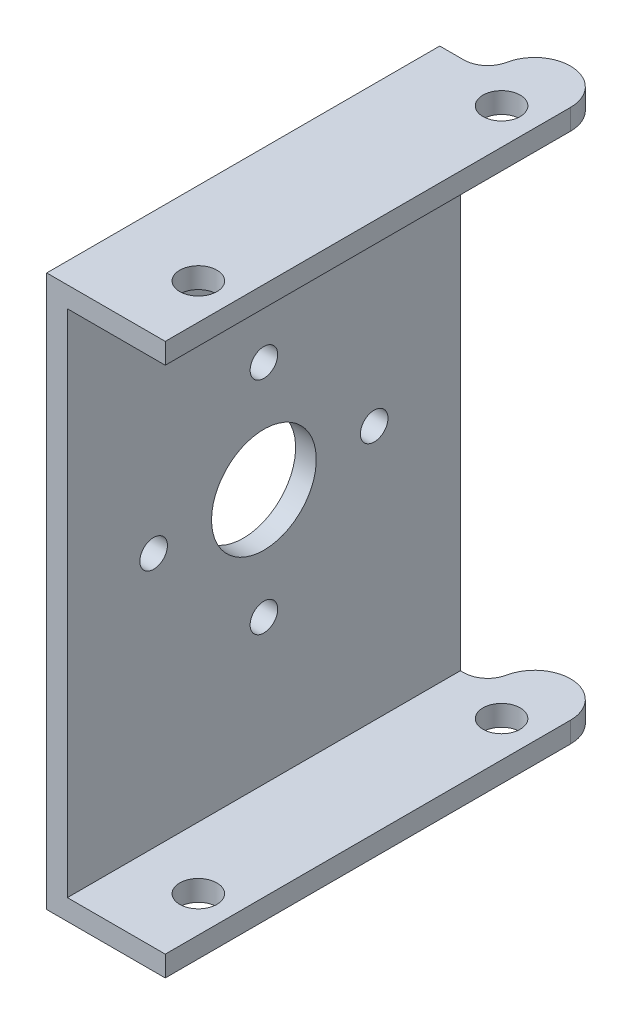
ISO-10303-21;
HEADER;
FILE_DESCRIPTION(('STEP AP214'),'2;1');
FILE_NAME('part.step','',(''),(''),'','','');
FILE_SCHEMA(('AUTOMOTIVE_DESIGN { 1 0 10303 214 1 1 1 1 }'));
ENDSEC;
DATA;
#1=APPLICATION_CONTEXT('core data for automotive mechanical design processes');
#2=APPLICATION_PROTOCOL_DEFINITION('international standard','automotive_design',2000,#1);
#3=PRODUCT_CONTEXT('',#1,'mechanical');
#4=PRODUCT('Part','Part','',(#3));
#5=PRODUCT_RELATED_PRODUCT_CATEGORY('part','',(#4));
#6=PRODUCT_DEFINITION_FORMATION('','',#4);
#7=PRODUCT_DEFINITION_CONTEXT('part definition',#1,'design');
#8=PRODUCT_DEFINITION('design','',#6,#7);
#9=PRODUCT_DEFINITION_SHAPE('','',#8);
#10=(LENGTH_UNIT() NAMED_UNIT(*) SI_UNIT(.MILLI.,.METRE.));
#11=(NAMED_UNIT(*) PLANE_ANGLE_UNIT() SI_UNIT($,.RADIAN.));
#12=(NAMED_UNIT(*) SI_UNIT($,.STERADIAN.) SOLID_ANGLE_UNIT());
#13=UNCERTAINTY_MEASURE_WITH_UNIT(LENGTH_MEASURE(1.E-05),#10,'distance_accuracy_value','');
#14=(GEOMETRIC_REPRESENTATION_CONTEXT(3) GLOBAL_UNCERTAINTY_ASSIGNED_CONTEXT((#13)) GLOBAL_UNIT_ASSIGNED_CONTEXT((#10,
#11,#12)) REPRESENTATION_CONTEXT('',''));
#15=CARTESIAN_POINT('',(0.,0.,0.));
#16=DIRECTION('',(0.,0.,1.));
#17=DIRECTION('',(1.,0.,0.));
#18=AXIS2_PLACEMENT_3D('',#15,#16,#17);
#19=CARTESIAN_POINT('',(8.6,0.,16.));
#20=DIRECTION('',(0.,1.,0.));
#21=DIRECTION('',(-1.,0.,0.));
#22=AXIS2_PLACEMENT_3D('',#19,#20,#21);
#23=PLANE('',#22);
#24=CARTESIAN_POINT('',(6.,0.,11.));
#25=DIRECTION('',(0.,1.,0.));
#26=DIRECTION('',(-1.,0.,0.));
#27=AXIS2_PLACEMENT_3D('',#24,#25,#26);
#28=CIRCLE('',#27,1.35);
#29=CARTESIAN_POINT('',(4.65,0.,11.));
#30=VERTEX_POINT('',#29);
#31=EDGE_CURVE('E162',#30,#30,#28,.T.);
#32=ORIENTED_EDGE('',*,*,#31,.T.);
#33=EDGE_LOOP('',(#32));
#34=FACE_BOUND('',#33,.T.);
#35=CARTESIAN_POINT('',(6.,0.,-11.));
#36=DIRECTION('',(0.,1.,0.));
#37=DIRECTION('',(-1.,0.,0.));
#38=AXIS2_PLACEMENT_3D('',#35,#36,#37);
#39=CIRCLE('',#38,1.35);
#40=CARTESIAN_POINT('',(4.65,0.,-11.));
#41=VERTEX_POINT('',#40);
#42=EDGE_CURVE('E174',#41,#41,#39,.T.);
#43=ORIENTED_EDGE('',*,*,#42,.T.);
#44=EDGE_LOOP('',(#43));
#45=FACE_BOUND('',#44,.T.);
#46=CARTESIAN_POINT('',(6.,0.,-13.4));
#47=DIRECTION('',(0.,1.,0.));
#48=DIRECTION('',(0.,0.,1.));
#49=AXIS2_PLACEMENT_3D('',#46,#47,#48);
#50=CIRCLE('',#49,2.6);
#51=CARTESIAN_POINT('',(8.6,0.,-13.4));
#52=VERTEX_POINT('',#51);
#53=CARTESIAN_POINT('',(3.45116228327821,0.,-13.9132507124364));
#54=VERTEX_POINT('',#53);
#55=EDGE_CURVE('E121',#52,#54,#50,.T.);
#56=ORIENTED_EDGE('',*,*,#55,.F.);
#57=DIRECTION('',(0.,0.,-1.));
#58=VECTOR('',#57,1.);
#59=CARTESIAN_POINT('',(8.6,0.,16.));
#60=LINE('',#59,#58);
#61=CARTESIAN_POINT('',(8.6,0.,16.));
#62=VERTEX_POINT('',#61);
#63=EDGE_CURVE('E11',#62,#52,#60,.T.);
#64=ORIENTED_EDGE('',*,*,#63,.F.);
#65=DIRECTION('',(1.,0.,0.));
#66=VECTOR('',#65,1.);
#67=CARTESIAN_POINT('',(8.6,0.,16.));
#68=LINE('',#67,#66);
#69=CARTESIAN_POINT('',(0.,0.,16.));
#70=VERTEX_POINT('',#69);
#71=EDGE_CURVE('E185',#70,#62,#68,.T.);
#72=ORIENTED_EDGE('',*,*,#71,.F.);
#73=DIRECTION('',(0.,0.,-1.));
#74=VECTOR('',#73,1.);
#75=CARTESIAN_POINT('',(0.,0.,16.));
#76=LINE('',#75,#74);
#77=CARTESIAN_POINT('',(0.,0.,-12.514544668059));
#78=VERTEX_POINT('',#77);
#79=EDGE_CURVE('E125',#70,#78,#76,.T.);
#80=ORIENTED_EDGE('',*,*,#79,.T.);
#81=DIRECTION('',(-1.,0.,0.));
#82=VECTOR('',#81,1.);
#83=CARTESIAN_POINT('',(0.,0.,-12.514544668059));
#84=LINE('',#83,#82);
#85=CARTESIAN_POINT('',(1.74272766597049,0.,-12.514544668059));
#86=VERTEX_POINT('',#85);
#87=EDGE_CURVE('E30',#86,#78,#84,.T.);
#88=ORIENTED_EDGE('',*,*,#87,.F.);
#89=CARTESIAN_POINT('',(1.74272766597049,0.,-14.2572723340295));
#90=DIRECTION('',(0.,1.,0.));
#91=DIRECTION('',(0.,0.,1.));
#92=AXIS2_PLACEMENT_3D('',#89,#90,#91);
#93=CIRCLE('',#92,1.74272766597049);
#94=EDGE_CURVE('E115',#86,#54,#93,.T.);
#95=ORIENTED_EDGE('',*,*,#94,.T.);
#96=EDGE_LOOP('',(#56,#64,#72,#80,#88,#95));
#97=FACE_BOUND('',#96,.T.);
#98=ADVANCED_FACE('F16',(#34,#45,#97),#23,.F.);
#99=CARTESIAN_POINT('',(1.5,1.5,16.));
#100=DIRECTION('',(0.,-1.,0.));
#101=DIRECTION('',(0.,0.,-1.));
#102=AXIS2_PLACEMENT_3D('',#99,#100,#101);
#103=PLANE('',#102);
#104=CARTESIAN_POINT('',(6.,1.5,11.));
#105=DIRECTION('',(0.,-1.,0.));
#106=DIRECTION('',(0.,0.,-1.));
#107=AXIS2_PLACEMENT_3D('',#104,#105,#106);
#108=CIRCLE('',#107,1.35);
#109=CARTESIAN_POINT('',(6.,1.5,9.65));
#110=VERTEX_POINT('',#109);
#111=EDGE_CURVE('E170',#110,#110,#108,.T.);
#112=ORIENTED_EDGE('',*,*,#111,.T.);
#113=EDGE_LOOP('',(#112));
#114=FACE_BOUND('',#113,.T.);
#115=CARTESIAN_POINT('',(6.,1.5,-11.));
#116=DIRECTION('',(0.,-1.,0.));
#117=DIRECTION('',(0.,0.,-1.));
#118=AXIS2_PLACEMENT_3D('',#115,#116,#117);
#119=CIRCLE('',#118,1.35);
#120=CARTESIAN_POINT('',(6.,1.5,-12.35));
#121=VERTEX_POINT('',#120);
#122=EDGE_CURVE('E182',#121,#121,#119,.T.);
#123=ORIENTED_EDGE('',*,*,#122,.T.);
#124=EDGE_LOOP('',(#123));
#125=FACE_BOUND('',#124,.T.);
#126=DIRECTION('',(0.,0.,-1.));
#127=VECTOR('',#126,1.);
#128=CARTESIAN_POINT('',(8.6,1.5,16.));
#129=LINE('',#128,#127);
#130=CARTESIAN_POINT('',(8.6,1.5,16.));
#131=VERTEX_POINT('',#130);
#132=CARTESIAN_POINT('',(8.6,1.5,-13.4));
#133=VERTEX_POINT('',#132);
#134=EDGE_CURVE('E23',#131,#133,#129,.T.);
#135=ORIENTED_EDGE('',*,*,#134,.T.);
#136=CARTESIAN_POINT('',(6.,1.5,-13.4));
#137=DIRECTION('',(0.,-1.,0.));
#138=DIRECTION('',(0.,0.,-1.));
#139=AXIS2_PLACEMENT_3D('',#136,#137,#138);
#140=CIRCLE('',#139,2.6);
#141=CARTESIAN_POINT('',(3.45116228327821,1.5,-13.9132507124364));
#142=VERTEX_POINT('',#141);
#143=EDGE_CURVE('E144',#142,#133,#140,.T.);
#144=ORIENTED_EDGE('',*,*,#143,.F.);
#145=CARTESIAN_POINT('',(1.74272766597049,1.5,-14.2572723340295));
#146=DIRECTION('',(0.,-1.,0.));
#147=DIRECTION('',(0.,0.,-1.));
#148=AXIS2_PLACEMENT_3D('',#145,#146,#147);
#149=CIRCLE('',#148,1.74272766597049);
#150=CARTESIAN_POINT('',(1.74272766597049,1.5,-12.514544668059));
#151=VERTEX_POINT('',#150);
#152=EDGE_CURVE('E159',#142,#151,#149,.T.);
#153=ORIENTED_EDGE('',*,*,#152,.T.);
#154=DIRECTION('',(1.,0.,0.));
#155=VECTOR('',#154,1.);
#156=CARTESIAN_POINT('',(1.49999999999997,1.5,-12.514544668059));
#157=LINE('',#156,#155);
#158=CARTESIAN_POINT('',(1.5,1.5,-12.514544668059));
#159=VERTEX_POINT('',#158);
#160=EDGE_CURVE('E107',#159,#151,#157,.T.);
#161=ORIENTED_EDGE('',*,*,#160,.F.);
#162=DIRECTION('',(0.,0.,-1.));
#163=VECTOR('',#162,1.);
#164=CARTESIAN_POINT('',(1.5,1.5,16.));
#165=LINE('',#164,#163);
#166=CARTESIAN_POINT('',(1.5,1.5,16.));
#167=VERTEX_POINT('',#166);
#168=EDGE_CURVE('E213',#167,#159,#165,.T.);
#169=ORIENTED_EDGE('',*,*,#168,.F.);
#170=DIRECTION('',(-1.,0.,0.));
#171=VECTOR('',#170,1.);
#172=CARTESIAN_POINT('',(1.5,1.5,16.));
#173=LINE('',#172,#171);
#174=EDGE_CURVE('E189',#131,#167,#173,.T.);
#175=ORIENTED_EDGE('',*,*,#174,.F.);
#176=EDGE_LOOP('',(#135,#144,#153,#161,#169,#175));
#177=FACE_BOUND('',#176,.T.);
#178=ADVANCED_FACE('F220',(#114,#125,#177),#103,.F.);
#179=CARTESIAN_POINT('',(1.5,38.5,16.));
#180=DIRECTION('',(-1.,0.,0.));
#181=DIRECTION('',(0.,-1.,0.));
#182=AXIS2_PLACEMENT_3D('',#179,#180,#181);
#183=PLANE('',#182);
#184=CARTESIAN_POINT('',(1.5,20.,9.74272766597049));
#185=DIRECTION('',(1.,0.,0.));
#186=DIRECTION('',(0.,0.,1.));
#187=AXIS2_PLACEMENT_3D('',#184,#185,#186);
#188=CIRCLE('',#187,1.);
#189=CARTESIAN_POINT('',(1.5,20.,10.7427276659705));
#190=VERTEX_POINT('',#189);
#191=EDGE_CURVE('E530',#190,#190,#188,.T.);
#192=ORIENTED_EDGE('',*,*,#191,.F.);
#193=EDGE_LOOP('',(#192));
#194=FACE_BOUND('',#193,.T.);
#195=CARTESIAN_POINT('',(1.5,12.,1.74272766597049));
#196=DIRECTION('',(1.,0.,0.));
#197=DIRECTION('',(0.,-1.,0.));
#198=AXIS2_PLACEMENT_3D('',#195,#196,#197);
#199=CIRCLE('',#198,1.);
#200=CARTESIAN_POINT('',(1.5,11.,1.74272766597049));
#201=VERTEX_POINT('',#200);
#202=EDGE_CURVE('E532',#201,#201,#199,.T.);
#203=ORIENTED_EDGE('',*,*,#202,.F.);
#204=EDGE_LOOP('',(#203));
#205=FACE_BOUND('',#204,.T.);
#206=CARTESIAN_POINT('',(1.5,20.,-6.25727233402951));
#207=DIRECTION('',(1.,0.,0.));
#208=DIRECTION('',(0.,0.,-1.));
#209=AXIS2_PLACEMENT_3D('',#206,#207,#208);
#210=CIRCLE('',#209,1.);
#211=CARTESIAN_POINT('',(1.5,20.,-7.25727233402951));
#212=VERTEX_POINT('',#211);
#213=EDGE_CURVE('E538',#212,#212,#210,.T.);
#214=ORIENTED_EDGE('',*,*,#213,.F.);
#215=EDGE_LOOP('',(#214));
#216=FACE_BOUND('',#215,.T.);
#217=CARTESIAN_POINT('',(1.5,28.,1.74272766597049));
#218=DIRECTION('',(1.,0.,0.));
#219=DIRECTION('',(0.,1.,0.));
#220=AXIS2_PLACEMENT_3D('',#217,#218,#219);
#221=CIRCLE('',#220,1.);
#222=CARTESIAN_POINT('',(1.5,29.,1.74272766597049));
#223=VERTEX_POINT('',#222);
#224=EDGE_CURVE('E544',#223,#223,#221,.T.);
#225=ORIENTED_EDGE('',*,*,#224,.F.);
#226=EDGE_LOOP('',(#225));
#227=FACE_BOUND('',#226,.T.);
#228=CARTESIAN_POINT('',(1.5,20.,1.74272766597049));
#229=DIRECTION('',(-1.,0.,0.));
#230=DIRECTION('',(0.,-1.,0.));
#231=AXIS2_PLACEMENT_3D('',#228,#229,#230);
#232=CIRCLE('',#231,3.8);
#233=CARTESIAN_POINT('',(1.5,16.2,1.74272766597049));
#234=VERTEX_POINT('',#233);
#235=EDGE_CURVE('E131',#234,#234,#232,.T.);
#236=ORIENTED_EDGE('',*,*,#235,.T.);
#237=EDGE_LOOP('',(#236));
#238=FACE_BOUND('',#237,.T.);
#239=DIRECTION('',(0.,-1.,0.));
#240=VECTOR('',#239,1.);
#241=CARTESIAN_POINT('',(1.5,38.5,-12.514544668059));
#242=LINE('',#241,#240);
#243=CARTESIAN_POINT('',(1.5,38.5,-12.514544668059));
#244=VERTEX_POINT('',#243);
#245=EDGE_CURVE('E153',#244,#159,#242,.T.);
#246=ORIENTED_EDGE('',*,*,#245,.F.);
#247=DIRECTION('',(0.,0.,-1.));
#248=VECTOR('',#247,1.);
#249=CARTESIAN_POINT('',(1.5,38.5,16.));
#250=LINE('',#249,#248);
#251=CARTESIAN_POINT('',(1.5,38.5,16.));
#252=VERTEX_POINT('',#251);
#253=EDGE_CURVE('E210',#252,#244,#250,.T.);
#254=ORIENTED_EDGE('',*,*,#253,.F.);
#255=DIRECTION('',(0.,1.,0.));
#256=VECTOR('',#255,1.);
#257=CARTESIAN_POINT('',(1.5,38.5,16.));
#258=LINE('',#257,#256);
#259=EDGE_CURVE('E191',#167,#252,#258,.T.);
#260=ORIENTED_EDGE('',*,*,#259,.F.);
#261=ORIENTED_EDGE('',*,*,#168,.T.);
#262=EDGE_LOOP('',(#246,#254,#260,#261));
#263=FACE_BOUND('',#262,.T.);
#264=ADVANCED_FACE('F232',(#194,#205,#216,#227,#238,#263),#183,.F.);
#265=CARTESIAN_POINT('',(8.6,38.5,16.));
#266=DIRECTION('',(0.,1.,0.));
#267=DIRECTION('',(0.,0.,1.));
#268=AXIS2_PLACEMENT_3D('',#265,#266,#267);
#269=PLANE('',#268);
#270=CARTESIAN_POINT('',(6.,38.5,11.));
#271=DIRECTION('',(0.,1.,0.));
#272=DIRECTION('',(0.,0.,1.));
#273=AXIS2_PLACEMENT_3D('',#270,#271,#272);
#274=CIRCLE('',#273,1.35);
#275=CARTESIAN_POINT('',(6.,38.5,12.35));
#276=VERTEX_POINT('',#275);
#277=EDGE_CURVE('E165',#276,#276,#274,.T.);
#278=ORIENTED_EDGE('',*,*,#277,.T.);
#279=EDGE_LOOP('',(#278));
#280=FACE_BOUND('',#279,.T.);
#281=CARTESIAN_POINT('',(6.,38.5,-11.));
#282=DIRECTION('',(0.,1.,0.));
#283=DIRECTION('',(0.,0.,1.));
#284=AXIS2_PLACEMENT_3D('',#281,#282,#283);
#285=CIRCLE('',#284,1.35);
#286=CARTESIAN_POINT('',(6.,38.5,-9.65));
#287=VERTEX_POINT('',#286);
#288=EDGE_CURVE('E177',#287,#287,#285,.T.);
#289=ORIENTED_EDGE('',*,*,#288,.T.);
#290=EDGE_LOOP('',(#289));
#291=FACE_BOUND('',#290,.T.);
#292=CARTESIAN_POINT('',(6.,38.5,-13.4));
#293=DIRECTION('',(0.,1.,0.));
#294=DIRECTION('',(0.,0.,1.));
#295=AXIS2_PLACEMENT_3D('',#292,#293,#294);
#296=CIRCLE('',#295,2.6);
#297=CARTESIAN_POINT('',(8.6,38.5,-13.4));
#298=VERTEX_POINT('',#297);
#299=CARTESIAN_POINT('',(3.45116228327821,38.5,-13.9132507124364));
#300=VERTEX_POINT('',#299);
#301=EDGE_CURVE('E148',#298,#300,#296,.T.);
#302=ORIENTED_EDGE('',*,*,#301,.F.);
#303=DIRECTION('',(0.,0.,-1.));
#304=VECTOR('',#303,1.);
#305=CARTESIAN_POINT('',(8.6,38.5,16.));
#306=LINE('',#305,#304);
#307=CARTESIAN_POINT('',(8.6,38.5,16.));
#308=VERTEX_POINT('',#307);
#309=EDGE_CURVE('E207',#308,#298,#306,.T.);
#310=ORIENTED_EDGE('',*,*,#309,.F.);
#311=DIRECTION('',(1.,0.,0.));
#312=VECTOR('',#311,1.);
#313=CARTESIAN_POINT('',(8.6,38.5,16.));
#314=LINE('',#313,#312);
#315=EDGE_CURVE('E193',#252,#308,#314,.T.);
#316=ORIENTED_EDGE('',*,*,#315,.F.);
#317=ORIENTED_EDGE('',*,*,#253,.T.);
#318=DIRECTION('',(-1.,0.,0.));
#319=VECTOR('',#318,1.);
#320=CARTESIAN_POINT('',(8.6,38.5,-12.514544668059));
#321=LINE('',#320,#319);
#322=CARTESIAN_POINT('',(1.74272766597049,38.5,-12.514544668059));
#323=VERTEX_POINT('',#322);
#324=EDGE_CURVE('E150',#323,#244,#321,.T.);
#325=ORIENTED_EDGE('',*,*,#324,.F.);
#326=CARTESIAN_POINT('',(1.74272766597049,38.5,-14.2572723340295));
#327=DIRECTION('',(0.,1.,0.));
#328=DIRECTION('',(0.,0.,1.));
#329=AXIS2_PLACEMENT_3D('',#326,#327,#328);
#330=CIRCLE('',#329,1.74272766597049);
#331=EDGE_CURVE('E156',#323,#300,#330,.T.);
#332=ORIENTED_EDGE('',*,*,#331,.T.);
#333=EDGE_LOOP('',(#302,#310,#316,#317,#325,#332));
#334=FACE_BOUND('',#333,.T.);
#335=ADVANCED_FACE('F238',(#280,#291,#334),#269,.F.);
#336=CARTESIAN_POINT('',(0.,40.,16.));
#337=DIRECTION('',(0.,-1.,0.));
#338=DIRECTION('',(0.,0.,-1.));
#339=AXIS2_PLACEMENT_3D('',#336,#337,#338);
#340=PLANE('',#339);
#341=CARTESIAN_POINT('',(6.,40.,11.));
#342=DIRECTION('',(0.,1.,0.));
#343=DIRECTION('',(-1.,0.,0.));
#344=AXIS2_PLACEMENT_3D('',#341,#342,#343);
#345=CIRCLE('',#344,1.35);
#346=CARTESIAN_POINT('',(4.65,40.,11.));
#347=VERTEX_POINT('',#346);
#348=EDGE_CURVE('E161',#347,#347,#345,.T.);
#349=ORIENTED_EDGE('',*,*,#348,.F.);
#350=EDGE_LOOP('',(#349));
#351=FACE_BOUND('',#350,.T.);
#352=CARTESIAN_POINT('',(6.,40.,-11.));
#353=DIRECTION('',(0.,1.,0.));
#354=DIRECTION('',(-1.,0.,0.));
#355=AXIS2_PLACEMENT_3D('',#352,#353,#354);
#356=CIRCLE('',#355,1.35);
#357=CARTESIAN_POINT('',(4.65,40.,-11.));
#358=VERTEX_POINT('',#357);
#359=EDGE_CURVE('E173',#358,#358,#356,.T.);
#360=ORIENTED_EDGE('',*,*,#359,.F.);
#361=EDGE_LOOP('',(#360));
#362=FACE_BOUND('',#361,.T.);
#363=CARTESIAN_POINT('',(6.,40.,-13.4));
#364=DIRECTION('',(0.,1.,0.));
#365=DIRECTION('',(0.,0.,1.));
#366=AXIS2_PLACEMENT_3D('',#363,#364,#365);
#367=CIRCLE('',#366,2.6);
#368=CARTESIAN_POINT('',(8.6,40.,-13.4));
#369=VERTEX_POINT('',#368);
#370=CARTESIAN_POINT('',(3.45116228327821,40.,-13.9132507124364));
#371=VERTEX_POINT('',#370);
#372=EDGE_CURVE('E126',#369,#371,#367,.T.);
#373=ORIENTED_EDGE('',*,*,#372,.T.);
#374=CARTESIAN_POINT('',(1.74272766597049,40.,-14.2572723340295));
#375=DIRECTION('',(0.,1.,0.));
#376=DIRECTION('',(0.,0.,1.));
#377=AXIS2_PLACEMENT_3D('',#374,#375,#376);
#378=CIRCLE('',#377,1.74272766597049);
#379=CARTESIAN_POINT('',(1.74272766597049,40.,-12.514544668059));
#380=VERTEX_POINT('',#379);
#381=EDGE_CURVE('E128',#380,#371,#378,.T.);
#382=ORIENTED_EDGE('',*,*,#381,.F.);
#383=DIRECTION('',(-1.,0.,0.));
#384=VECTOR('',#383,1.);
#385=CARTESIAN_POINT('',(0.,40.,-12.514544668059));
#386=LINE('',#385,#384);
#387=CARTESIAN_POINT('',(0.,40.,-12.514544668059));
#388=VERTEX_POINT('',#387);
#389=EDGE_CURVE('E136',#380,#388,#386,.T.);
#390=ORIENTED_EDGE('',*,*,#389,.T.);
#391=DIRECTION('',(0.,0.,-1.));
#392=VECTOR('',#391,1.);
#393=CARTESIAN_POINT('',(0.,40.,16.));
#394=LINE('',#393,#392);
#395=CARTESIAN_POINT('',(0.,40.,16.));
#396=VERTEX_POINT('',#395);
#397=EDGE_CURVE('E201',#396,#388,#394,.T.);
#398=ORIENTED_EDGE('',*,*,#397,.F.);
#399=DIRECTION('',(-1.,0.,0.));
#400=VECTOR('',#399,1.);
#401=CARTESIAN_POINT('',(0.,40.,16.));
#402=LINE('',#401,#400);
#403=CARTESIAN_POINT('',(8.6,40.,16.));
#404=VERTEX_POINT('',#403);
#405=EDGE_CURVE('E197',#404,#396,#402,.T.);
#406=ORIENTED_EDGE('',*,*,#405,.F.);
#407=DIRECTION('',(0.,0.,-1.));
#408=VECTOR('',#407,1.);
#409=CARTESIAN_POINT('',(8.6,40.,16.));
#410=LINE('',#409,#408);
#411=EDGE_CURVE('E204',#404,#369,#410,.T.);
#412=ORIENTED_EDGE('',*,*,#411,.T.);
#413=EDGE_LOOP('',(#373,#382,#390,#398,#406,#412));
#414=FACE_BOUND('',#413,.T.);
#415=ADVANCED_FACE('F247',(#351,#362,#414),#340,.F.);
#416=CARTESIAN_POINT('',(0.,0.,16.));
#417=DIRECTION('',(1.,0.,0.));
#418=DIRECTION('',(0.,0.,-1.));
#419=AXIS2_PLACEMENT_3D('',#416,#417,#418);
#420=PLANE('',#419);
#421=CARTESIAN_POINT('',(0.,20.,9.74272766597049));
#422=DIRECTION('',(1.,0.,0.));
#423=DIRECTION('',(0.,0.,1.));
#424=AXIS2_PLACEMENT_3D('',#421,#422,#423);
#425=CIRCLE('',#424,1.);
#426=CARTESIAN_POINT('',(0.,20.,10.7427276659705));
#427=VERTEX_POINT('',#426);
#428=EDGE_CURVE('E527',#427,#427,#425,.T.);
#429=ORIENTED_EDGE('',*,*,#428,.T.);
#430=EDGE_LOOP('',(#429));
#431=FACE_BOUND('',#430,.T.);
#432=CARTESIAN_POINT('',(0.,12.,1.74272766597049));
#433=DIRECTION('',(1.,0.,0.));
#434=DIRECTION('',(0.,-1.,0.));
#435=AXIS2_PLACEMENT_3D('',#432,#433,#434);
#436=CIRCLE('',#435,1.);
#437=CARTESIAN_POINT('',(0.,11.,1.74272766597049));
#438=VERTEX_POINT('',#437);
#439=EDGE_CURVE('E535',#438,#438,#436,.T.);
#440=ORIENTED_EDGE('',*,*,#439,.T.);
#441=EDGE_LOOP('',(#440));
#442=FACE_BOUND('',#441,.T.);
#443=CARTESIAN_POINT('',(0.,20.,-6.25727233402951));
#444=DIRECTION('',(1.,0.,0.));
#445=DIRECTION('',(0.,0.,-1.));
#446=AXIS2_PLACEMENT_3D('',#443,#444,#445);
#447=CIRCLE('',#446,1.);
#448=CARTESIAN_POINT('',(0.,20.,-7.25727233402951));
#449=VERTEX_POINT('',#448);
#450=EDGE_CURVE('E541',#449,#449,#447,.T.);
#451=ORIENTED_EDGE('',*,*,#450,.T.);
#452=EDGE_LOOP('',(#451));
#453=FACE_BOUND('',#452,.T.);
#454=CARTESIAN_POINT('',(0.,28.,1.74272766597049));
#455=DIRECTION('',(1.,0.,0.));
#456=DIRECTION('',(0.,1.,0.));
#457=AXIS2_PLACEMENT_3D('',#454,#455,#456);
#458=CIRCLE('',#457,1.);
#459=CARTESIAN_POINT('',(0.,29.,1.74272766597049));
#460=VERTEX_POINT('',#459);
#461=EDGE_CURVE('E547',#460,#460,#458,.T.);
#462=ORIENTED_EDGE('',*,*,#461,.T.);
#463=EDGE_LOOP('',(#462));
#464=FACE_BOUND('',#463,.T.);
#465=CARTESIAN_POINT('',(0.,20.,1.74272766597049));
#466=DIRECTION('',(-1.,0.,0.));
#467=DIRECTION('',(0.,0.,1.));
#468=AXIS2_PLACEMENT_3D('',#465,#466,#467);
#469=CIRCLE('',#468,3.8);
#470=CARTESIAN_POINT('',(0.,20.,5.54272766597049));
#471=VERTEX_POINT('',#470);
#472=EDGE_CURVE('E550',#471,#471,#469,.T.);
#473=ORIENTED_EDGE('',*,*,#472,.F.);
#474=EDGE_LOOP('',(#473));
#475=FACE_BOUND('',#474,.T.);
#476=DIRECTION('',(0.,1.,0.));
#477=VECTOR('',#476,1.);
#478=CARTESIAN_POINT('',(0.,0.,-12.514544668059));
#479=LINE('',#478,#477);
#480=EDGE_CURVE('E135',#78,#388,#479,.T.);
#481=ORIENTED_EDGE('',*,*,#480,.F.);
#482=ORIENTED_EDGE('',*,*,#79,.F.);
#483=DIRECTION('',(0.,-1.,0.));
#484=VECTOR('',#483,1.);
#485=CARTESIAN_POINT('',(0.,0.,16.));
#486=LINE('',#485,#484);
#487=EDGE_CURVE('E38',#396,#70,#486,.T.);
#488=ORIENTED_EDGE('',*,*,#487,.F.);
#489=ORIENTED_EDGE('',*,*,#397,.T.);
#490=EDGE_LOOP('',(#481,#482,#488,#489));
#491=FACE_BOUND('',#490,.T.);
#492=ADVANCED_FACE('F251',(#431,#442,#453,#464,#475,#491),#420,.F.);
#493=CARTESIAN_POINT('',(8.6,1.5,16.));
#494=DIRECTION('',(-1.,0.,0.));
#495=DIRECTION('',(0.,0.,1.));
#496=AXIS2_PLACEMENT_3D('',#493,#494,#495);
#497=PLANE('',#496);
#498=ORIENTED_EDGE('',*,*,#63,.T.);
#499=DIRECTION('',(0.,1.,0.));
#500=VECTOR('',#499,1.);
#501=CARTESIAN_POINT('',(8.6,0.,-13.4));
#502=LINE('',#501,#500);
#503=EDGE_CURVE('E141',#52,#133,#502,.T.);
#504=ORIENTED_EDGE('',*,*,#503,.T.);
#505=ORIENTED_EDGE('',*,*,#134,.F.);
#506=DIRECTION('',(0.,1.,0.));
#507=VECTOR('',#506,1.);
#508=CARTESIAN_POINT('',(8.6,1.5,16.));
#509=LINE('',#508,#507);
#510=EDGE_CURVE('E187',#62,#131,#509,.T.);
#511=ORIENTED_EDGE('',*,*,#510,.F.);
#512=EDGE_LOOP('',(#498,#504,#505,#511));
#513=FACE_BOUND('',#512,.T.);
#514=ADVANCED_FACE('F223',(#513),#497,.F.);
#515=CARTESIAN_POINT('',(8.6,40.,16.));
#516=DIRECTION('',(-1.,0.,0.));
#517=DIRECTION('',(0.,0.,1.));
#518=AXIS2_PLACEMENT_3D('',#515,#516,#517);
#519=PLANE('',#518);
#520=ORIENTED_EDGE('',*,*,#309,.T.);
#521=EDGE_CURVE('E145',#298,#369,#502,.T.);
#522=ORIENTED_EDGE('',*,*,#521,.T.);
#523=ORIENTED_EDGE('',*,*,#411,.F.);
#524=DIRECTION('',(0.,1.,0.));
#525=VECTOR('',#524,1.);
#526=CARTESIAN_POINT('',(8.6,40.,16.));
#527=LINE('',#526,#525);
#528=EDGE_CURVE('E195',#308,#404,#527,.T.);
#529=ORIENTED_EDGE('',*,*,#528,.F.);
#530=EDGE_LOOP('',(#520,#522,#523,#529));
#531=FACE_BOUND('',#530,.T.);
#532=ADVANCED_FACE('F245',(#531),#519,.F.);
#533=CARTESIAN_POINT('',(0.,0.,16.));
#534=DIRECTION('',(0.,0.,-1.));
#535=DIRECTION('',(-1.,0.,0.));
#536=AXIS2_PLACEMENT_3D('',#533,#534,#535);
#537=PLANE('',#536);
#538=ORIENTED_EDGE('',*,*,#71,.T.);
#539=ORIENTED_EDGE('',*,*,#510,.T.);
#540=ORIENTED_EDGE('',*,*,#174,.T.);
#541=ORIENTED_EDGE('',*,*,#259,.T.);
#542=ORIENTED_EDGE('',*,*,#315,.T.);
#543=ORIENTED_EDGE('',*,*,#528,.T.);
#544=ORIENTED_EDGE('',*,*,#405,.T.);
#545=ORIENTED_EDGE('',*,*,#487,.T.);
#546=EDGE_LOOP('',(#538,#539,#540,#541,#542,#543,#544,#545));
#547=FACE_BOUND('',#546,.T.);
#548=ADVANCED_FACE('F227',(#547),#537,.F.);
#549=CARTESIAN_POINT('',(6.,0.,-11.));
#550=DIRECTION('',(0.,1.,0.));
#551=DIRECTION('',(-1.,0.,0.));
#552=AXIS2_PLACEMENT_3D('',#549,#550,#551);
#553=CYLINDRICAL_SURFACE('',#552,1.35);
#554=ORIENTED_EDGE('',*,*,#359,.T.);
#555=EDGE_LOOP('',(#554));
#556=FACE_BOUND('',#555,.T.);
#557=ORIENTED_EDGE('',*,*,#288,.F.);
#558=EDGE_LOOP('',(#557));
#559=FACE_BOUND('',#558,.T.);
#560=ADVANCED_FACE('F286',(#556,#559),#553,.F.);
#561=ORIENTED_EDGE('',*,*,#42,.F.);
#562=EDGE_LOOP('',(#561));
#563=FACE_BOUND('',#562,.T.);
#564=ORIENTED_EDGE('',*,*,#122,.F.);
#565=EDGE_LOOP('',(#564));
#566=FACE_BOUND('',#565,.T.);
#567=ADVANCED_FACE('F282',(#563,#566),#553,.F.);
#568=CARTESIAN_POINT('',(6.,0.,11.));
#569=DIRECTION('',(0.,1.,0.));
#570=DIRECTION('',(-1.,0.,0.));
#571=AXIS2_PLACEMENT_3D('',#568,#569,#570);
#572=CYLINDRICAL_SURFACE('',#571,1.35);
#573=ORIENTED_EDGE('',*,*,#348,.T.);
#574=EDGE_LOOP('',(#573));
#575=FACE_BOUND('',#574,.T.);
#576=ORIENTED_EDGE('',*,*,#277,.F.);
#577=EDGE_LOOP('',(#576));
#578=FACE_BOUND('',#577,.T.);
#579=ADVANCED_FACE('F285',(#575,#578),#572,.F.);
#580=ORIENTED_EDGE('',*,*,#31,.F.);
#581=EDGE_LOOP('',(#580));
#582=FACE_BOUND('',#581,.T.);
#583=ORIENTED_EDGE('',*,*,#111,.F.);
#584=EDGE_LOOP('',(#583));
#585=FACE_BOUND('',#584,.T.);
#586=ADVANCED_FACE('F294',(#582,#585),#572,.F.);
#587=CARTESIAN_POINT('',(1.74272766597049,0.,-14.2572723340295));
#588=DIRECTION('',(0.,1.,0.));
#589=DIRECTION('',(0.,0.,1.));
#590=AXIS2_PLACEMENT_3D('',#587,#588,#589);
#591=CYLINDRICAL_SURFACE('',#590,1.74272766597049);
#592=DIRECTION('',(0.,1.,0.));
#593=VECTOR('',#592,1.);
#594=CARTESIAN_POINT('',(3.45116228327821,0.,-13.9132507124364));
#595=LINE('',#594,#593);
#596=EDGE_CURVE('E118',#54,#142,#595,.T.);
#597=ORIENTED_EDGE('',*,*,#596,.F.);
#598=ORIENTED_EDGE('',*,*,#94,.F.);
#599=DIRECTION('',(0.,1.,0.));
#600=VECTOR('',#599,1.);
#601=CARTESIAN_POINT('',(1.74272766597049,0.,-12.514544668059));
#602=LINE('',#601,#600);
#603=EDGE_CURVE('E103',#86,#151,#602,.T.);
#604=ORIENTED_EDGE('',*,*,#603,.T.);
#605=ORIENTED_EDGE('',*,*,#152,.F.);
#606=EDGE_LOOP('',(#597,#598,#604,#605));
#607=FACE_BOUND('',#606,.T.);
#608=ADVANCED_FACE('F116',(#607),#591,.F.);
#609=EDGE_CURVE('E111',#323,#380,#602,.T.);
#610=ORIENTED_EDGE('',*,*,#609,.T.);
#611=ORIENTED_EDGE('',*,*,#381,.T.);
#612=EDGE_CURVE('E110',#300,#371,#595,.T.);
#613=ORIENTED_EDGE('',*,*,#612,.F.);
#614=ORIENTED_EDGE('',*,*,#331,.F.);
#615=EDGE_LOOP('',(#610,#611,#613,#614));
#616=FACE_BOUND('',#615,.T.);
#617=ADVANCED_FACE('F256',(#616),#591,.F.);
#618=CARTESIAN_POINT('',(0.,0.,-12.514544668059));
#619=DIRECTION('',(0.,0.,-1.));
#620=DIRECTION('',(-1.,0.,0.));
#621=AXIS2_PLACEMENT_3D('',#618,#619,#620);
#622=PLANE('',#621);
#623=ORIENTED_EDGE('',*,*,#160,.T.);
#624=ORIENTED_EDGE('',*,*,#603,.F.);
#625=ORIENTED_EDGE('',*,*,#87,.T.);
#626=ORIENTED_EDGE('',*,*,#480,.T.);
#627=ORIENTED_EDGE('',*,*,#389,.F.);
#628=ORIENTED_EDGE('',*,*,#609,.F.);
#629=ORIENTED_EDGE('',*,*,#324,.T.);
#630=ORIENTED_EDGE('',*,*,#245,.T.);
#631=EDGE_LOOP('',(#623,#624,#625,#626,#627,#628,#629,#630));
#632=FACE_BOUND('',#631,.T.);
#633=ADVANCED_FACE('F105',(#632),#622,.T.);
#634=CARTESIAN_POINT('',(6.,0.,-13.4));
#635=DIRECTION('',(0.,1.,0.));
#636=DIRECTION('',(0.,0.,1.));
#637=AXIS2_PLACEMENT_3D('',#634,#635,#636);
#638=CYLINDRICAL_SURFACE('',#637,2.6);
#639=ORIENTED_EDGE('',*,*,#143,.T.);
#640=ORIENTED_EDGE('',*,*,#503,.F.);
#641=ORIENTED_EDGE('',*,*,#55,.T.);
#642=ORIENTED_EDGE('',*,*,#596,.T.);
#643=EDGE_LOOP('',(#639,#640,#641,#642));
#644=FACE_BOUND('',#643,.T.);
#645=ADVANCED_FACE('F226',(#644),#638,.T.);
#646=ORIENTED_EDGE('',*,*,#301,.T.);
#647=ORIENTED_EDGE('',*,*,#612,.T.);
#648=ORIENTED_EDGE('',*,*,#372,.F.);
#649=ORIENTED_EDGE('',*,*,#521,.F.);
#650=EDGE_LOOP('',(#646,#647,#648,#649));
#651=FACE_BOUND('',#650,.T.);
#652=ADVANCED_FACE('F258',(#651),#638,.T.);
#653=CARTESIAN_POINT('',(8.6,20.,1.74272766597049));
#654=DIRECTION('',(-1.,0.,0.));
#655=DIRECTION('',(0.,0.,1.));
#656=AXIS2_PLACEMENT_3D('',#653,#654,#655);
#657=CYLINDRICAL_SURFACE('',#656,3.8);
#658=ORIENTED_EDGE('',*,*,#472,.T.);
#659=EDGE_LOOP('',(#658));
#660=FACE_BOUND('',#659,.T.);
#661=ORIENTED_EDGE('',*,*,#235,.F.);
#662=EDGE_LOOP('',(#661));
#663=FACE_BOUND('',#662,.T.);
#664=ADVANCED_FACE('F260',(#660,#663),#657,.F.);
#665=CARTESIAN_POINT('',(0.,28.,1.74272766597049));
#666=DIRECTION('',(1.,0.,0.));
#667=DIRECTION('',(0.,1.,0.));
#668=AXIS2_PLACEMENT_3D('',#665,#666,#667);
#669=CYLINDRICAL_SURFACE('',#668,1.);
#670=ORIENTED_EDGE('',*,*,#461,.F.);
#671=EDGE_LOOP('',(#670));
#672=FACE_BOUND('',#671,.T.);
#673=ORIENTED_EDGE('',*,*,#224,.T.);
#674=EDGE_LOOP('',(#673));
#675=FACE_BOUND('',#674,.T.);
#676=ADVANCED_FACE('F267',(#672,#675),#669,.F.);
#677=CARTESIAN_POINT('',(0.,20.,-6.25727233402951));
#678=DIRECTION('',(1.,0.,0.));
#679=DIRECTION('',(0.,1.,0.));
#680=AXIS2_PLACEMENT_3D('',#677,#678,#679);
#681=CYLINDRICAL_SURFACE('',#680,1.);
#682=ORIENTED_EDGE('',*,*,#450,.F.);
#683=EDGE_LOOP('',(#682));
#684=FACE_BOUND('',#683,.T.);
#685=ORIENTED_EDGE('',*,*,#213,.T.);
#686=EDGE_LOOP('',(#685));
#687=FACE_BOUND('',#686,.T.);
#688=ADVANCED_FACE('F411',(#684,#687),#681,.F.);
#689=CARTESIAN_POINT('',(0.,12.,1.74272766597049));
#690=DIRECTION('',(1.,0.,0.));
#691=DIRECTION('',(0.,1.,0.));
#692=AXIS2_PLACEMENT_3D('',#689,#690,#691);
#693=CYLINDRICAL_SURFACE('',#692,1.);
#694=ORIENTED_EDGE('',*,*,#439,.F.);
#695=EDGE_LOOP('',(#694));
#696=FACE_BOUND('',#695,.T.);
#697=ORIENTED_EDGE('',*,*,#202,.T.);
#698=EDGE_LOOP('',(#697));
#699=FACE_BOUND('',#698,.T.);
#700=ADVANCED_FACE('F422',(#696,#699),#693,.F.);
#701=CARTESIAN_POINT('',(0.,20.,9.74272766597049));
#702=DIRECTION('',(1.,0.,0.));
#703=DIRECTION('',(0.,1.,0.));
#704=AXIS2_PLACEMENT_3D('',#701,#702,#703);
#705=CYLINDRICAL_SURFACE('',#704,1.);
#706=ORIENTED_EDGE('',*,*,#428,.F.);
#707=EDGE_LOOP('',(#706));
#708=FACE_BOUND('',#707,.T.);
#709=ORIENTED_EDGE('',*,*,#191,.T.);
#710=EDGE_LOOP('',(#709));
#711=FACE_BOUND('',#710,.T.);
#712=ADVANCED_FACE('F433',(#708,#711),#705,.F.);
#713=CLOSED_SHELL('',(#98,#178,#264,#335,#415,#492,#514,#532,#548,#560,#567,#579,#586,#608,#617,
#633,#645,#652,#664,#676,#688,#700,#712));
#714=MANIFOLD_SOLID_BREP('B1',#713);
#715=ADVANCED_BREP_SHAPE_REPRESENTATION('',(#18,#714),#14);
#716=SHAPE_DEFINITION_REPRESENTATION(#9,#715);
ENDSEC;
END-ISO-10303-21;
